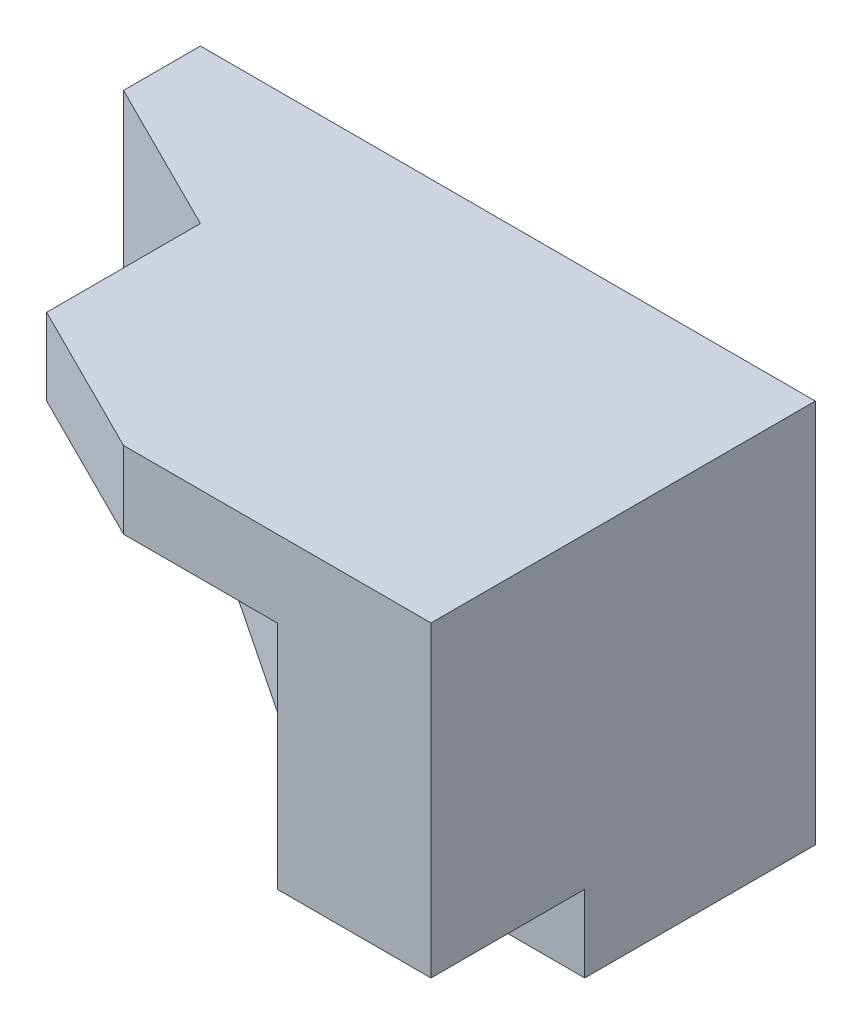
ISO-10303-21;
HEADER;
FILE_DESCRIPTION(('STEP AP214'),'2;1');
FILE_NAME('part.step','',(''),(''),'','','');
FILE_SCHEMA(('AUTOMOTIVE_DESIGN { 1 0 10303 214 1 1 1 1 }'));
ENDSEC;
DATA;
#1=APPLICATION_CONTEXT('core data for automotive mechanical design processes');
#2=APPLICATION_PROTOCOL_DEFINITION('international standard','automotive_design',2000,#1);
#3=PRODUCT_CONTEXT('',#1,'mechanical');
#4=PRODUCT('Part','Part','',(#3));
#5=PRODUCT_RELATED_PRODUCT_CATEGORY('part','',(#4));
#6=PRODUCT_DEFINITION_FORMATION('','',#4);
#7=PRODUCT_DEFINITION_CONTEXT('part definition',#1,'design');
#8=PRODUCT_DEFINITION('design','',#6,#7);
#9=PRODUCT_DEFINITION_SHAPE('','',#8);
#10=(LENGTH_UNIT() NAMED_UNIT(*) SI_UNIT(.MILLI.,.METRE.));
#11=(NAMED_UNIT(*) PLANE_ANGLE_UNIT() SI_UNIT($,.RADIAN.));
#12=(NAMED_UNIT(*) SI_UNIT($,.STERADIAN.) SOLID_ANGLE_UNIT());
#13=UNCERTAINTY_MEASURE_WITH_UNIT(LENGTH_MEASURE(1.E-05),#10,'distance_accuracy_value','');
#14=(GEOMETRIC_REPRESENTATION_CONTEXT(3) GLOBAL_UNCERTAINTY_ASSIGNED_CONTEXT((#13)) GLOBAL_UNIT_ASSIGNED_CONTEXT((#10,
#11,#12)) REPRESENTATION_CONTEXT('',''));
#15=CARTESIAN_POINT('',(0.,0.,0.));
#16=DIRECTION('',(0.,0.,1.));
#17=DIRECTION('',(1.,0.,0.));
#18=AXIS2_PLACEMENT_3D('',#15,#16,#17);
#19=CARTESIAN_POINT('',(20.,50.,23.4135169851584));
#20=DIRECTION('',(-1.,0.,0.));
#21=DIRECTION('',(0.,-1.,0.));
#22=AXIS2_PLACEMENT_3D('',#19,#20,#21);
#23=PLANE('',#22);
#24=DIRECTION('',(0.,0.,-1.));
#25=VECTOR('',#24,1.);
#26=CARTESIAN_POINT('',(20.,50.,40.));
#27=LINE('',#26,#25);
#28=CARTESIAN_POINT('',(20.,50.,40.));
#29=VERTEX_POINT('',#28);
#30=CARTESIAN_POINT('',(20.,50.,20.));
#31=VERTEX_POINT('',#30);
#32=EDGE_CURVE('E173',#29,#31,#27,.T.);
#33=ORIENTED_EDGE('',*,*,#32,.T.);
#34=DIRECTION('',(0.,-1.,0.));
#35=VECTOR('',#34,1.);
#36=CARTESIAN_POINT('',(20.,50.,20.));
#37=LINE('',#36,#35);
#38=CARTESIAN_POINT('',(20.,40.,20.));
#39=VERTEX_POINT('',#38);
#40=EDGE_CURVE('E11',#31,#39,#37,.T.);
#41=ORIENTED_EDGE('',*,*,#40,.T.);
#42=DIRECTION('',(0.,0.,-1.));
#43=VECTOR('',#42,1.);
#44=CARTESIAN_POINT('',(20.,40.,23.4135169851584));
#45=LINE('',#44,#43);
#46=CARTESIAN_POINT('',(20.,40.,40.));
#47=VERTEX_POINT('',#46);
#48=EDGE_CURVE('E166',#47,#39,#45,.T.);
#49=ORIENTED_EDGE('',*,*,#48,.F.);
#50=DIRECTION('',(0.,-1.,0.));
#51=VECTOR('',#50,1.);
#52=CARTESIAN_POINT('',(20.,50.,40.));
#53=LINE('',#52,#51);
#54=EDGE_CURVE('E174',#29,#47,#53,.T.);
#55=ORIENTED_EDGE('',*,*,#54,.F.);
#56=EDGE_LOOP('',(#33,#41,#49,#55));
#57=FACE_BOUND('',#56,.T.);
#58=ADVANCED_FACE('F35',(#57),#23,.T.);
#59=CARTESIAN_POINT('',(0.,0.,0.));
#60=DIRECTION('',(0.,0.,-1.));
#61=DIRECTION('',(-1.,0.,0.));
#62=AXIS2_PLACEMENT_3D('',#59,#60,#61);
#63=PLANE('',#62);
#64=DIRECTION('',(0.,-1.,0.));
#65=VECTOR('',#64,1.);
#66=CARTESIAN_POINT('',(0.,0.,0.));
#67=LINE('',#66,#65);
#68=CARTESIAN_POINT('',(0.,50.,0.));
#69=VERTEX_POINT('',#68);
#70=CARTESIAN_POINT('',(0.,30.,0.));
#71=VERTEX_POINT('',#70);
#72=EDGE_CURVE('E154',#69,#71,#67,.T.);
#73=ORIENTED_EDGE('',*,*,#72,.F.);
#74=DIRECTION('',(-1.,0.,0.));
#75=VECTOR('',#74,1.);
#76=CARTESIAN_POINT('',(0.,50.,0.));
#77=LINE('',#76,#75);
#78=CARTESIAN_POINT('',(80.,50.,0.));
#79=VERTEX_POINT('',#78);
#80=EDGE_CURVE('E149',#79,#69,#77,.T.);
#81=ORIENTED_EDGE('',*,*,#80,.F.);
#82=DIRECTION('',(0.,1.,0.));
#83=VECTOR('',#82,1.);
#84=CARTESIAN_POINT('',(80.,0.,0.));
#85=LINE('',#84,#83);
#86=CARTESIAN_POINT('',(80.,0.,0.));
#87=VERTEX_POINT('',#86);
#88=EDGE_CURVE('E252',#87,#79,#85,.T.);
#89=ORIENTED_EDGE('',*,*,#88,.F.);
#90=DIRECTION('',(1.,0.,0.));
#91=VECTOR('',#90,1.);
#92=CARTESIAN_POINT('',(0.,0.,0.));
#93=LINE('',#92,#91);
#94=CARTESIAN_POINT('',(60.,0.,0.));
#95=VERTEX_POINT('',#94);
#96=EDGE_CURVE('E250',#95,#87,#93,.T.);
#97=ORIENTED_EDGE('',*,*,#96,.F.);
#98=DIRECTION('',(0.,1.,0.));
#99=VECTOR('',#98,1.);
#100=CARTESIAN_POINT('',(60.,0.,0.));
#101=LINE('',#100,#99);
#102=CARTESIAN_POINT('',(60.,10.,0.));
#103=VERTEX_POINT('',#102);
#104=EDGE_CURVE('E235',#95,#103,#101,.T.);
#105=ORIENTED_EDGE('',*,*,#104,.T.);
#106=DIRECTION('',(-1.,0.,0.));
#107=VECTOR('',#106,1.);
#108=CARTESIAN_POINT('',(60.,10.,0.));
#109=LINE('',#108,#107);
#110=CARTESIAN_POINT('',(40.,10.,0.));
#111=VERTEX_POINT('',#110);
#112=EDGE_CURVE('E238',#103,#111,#109,.T.);
#113=ORIENTED_EDGE('',*,*,#112,.T.);
#114=DIRECTION('',(-0.894427190999916,0.447213595499958,0.));
#115=VECTOR('',#114,1.);
#116=CARTESIAN_POINT('',(40.,10.,0.));
#117=LINE('',#116,#115);
#118=EDGE_CURVE('E228',#111,#71,#117,.T.);
#119=ORIENTED_EDGE('',*,*,#118,.T.);
#120=EDGE_LOOP('',(#73,#81,#89,#97,#105,#113,#119));
#121=FACE_BOUND('',#120,.T.);
#122=ADVANCED_FACE('F269',(#121),#63,.T.);
#123=CARTESIAN_POINT('',(80.,40.,10.));
#124=DIRECTION('',(0.,-1.,0.));
#125=DIRECTION('',(1.,0.,0.));
#126=AXIS2_PLACEMENT_3D('',#123,#124,#125);
#127=PLANE('',#126);
#128=ORIENTED_EDGE('',*,*,#48,.T.);
#129=DIRECTION('',(0.894427190999916,0.,0.447213595499958));
#130=VECTOR('',#129,1.);
#131=CARTESIAN_POINT('',(60.,40.,40.));
#132=LINE('',#131,#130);
#133=CARTESIAN_POINT('',(60.,40.,40.));
#134=VERTEX_POINT('',#133);
#135=EDGE_CURVE('E53',#39,#134,#132,.T.);
#136=ORIENTED_EDGE('',*,*,#135,.T.);
#137=DIRECTION('',(0.,0.,1.));
#138=VECTOR('',#137,1.);
#139=CARTESIAN_POINT('',(60.,40.,40.));
#140=LINE('',#139,#138);
#141=CARTESIAN_POINT('',(60.,40.,50.));
#142=VERTEX_POINT('',#141);
#143=EDGE_CURVE('E185',#134,#142,#140,.T.);
#144=ORIENTED_EDGE('',*,*,#143,.T.);
#145=DIRECTION('',(1.,0.,0.));
#146=VECTOR('',#145,1.);
#147=CARTESIAN_POINT('',(80.,40.,50.));
#148=LINE('',#147,#146);
#149=CARTESIAN_POINT('',(40.,40.,50.));
#150=VERTEX_POINT('',#149);
#151=EDGE_CURVE('E183',#150,#142,#148,.T.);
#152=ORIENTED_EDGE('',*,*,#151,.F.);
#153=DIRECTION('',(-0.894427190999916,0.,-0.447213595499958));
#154=VECTOR('',#153,1.);
#155=CARTESIAN_POINT('',(40.,40.,50.));
#156=LINE('',#155,#154);
#157=EDGE_CURVE('E163',#150,#47,#156,.T.);
#158=ORIENTED_EDGE('',*,*,#157,.T.);
#159=EDGE_LOOP('',(#128,#136,#144,#152,#158));
#160=FACE_BOUND('',#159,.T.);
#161=ADVANCED_FACE('F302',(#160),#127,.T.);
#162=CARTESIAN_POINT('',(0.,0.,10.));
#163=DIRECTION('',(1.,0.,0.));
#164=DIRECTION('',(0.,0.,-1.));
#165=AXIS2_PLACEMENT_3D('',#162,#163,#164);
#166=PLANE('',#165);
#167=ORIENTED_EDGE('',*,*,#72,.T.);
#168=DIRECTION('',(0.,0.,1.));
#169=VECTOR('',#168,1.);
#170=CARTESIAN_POINT('',(0.,30.,0.));
#171=LINE('',#170,#169);
#172=CARTESIAN_POINT('',(0.,30.,10.));
#173=VERTEX_POINT('',#172);
#174=EDGE_CURVE('E152',#71,#173,#171,.T.);
#175=ORIENTED_EDGE('',*,*,#174,.T.);
#176=DIRECTION('',(0.,-1.,0.));
#177=VECTOR('',#176,1.);
#178=CARTESIAN_POINT('',(0.,0.,10.));
#179=LINE('',#178,#177);
#180=CARTESIAN_POINT('',(0.,50.,10.));
#181=VERTEX_POINT('',#180);
#182=EDGE_CURVE('E138',#181,#173,#179,.T.);
#183=ORIENTED_EDGE('',*,*,#182,.F.);
#184=DIRECTION('',(0.,0.,-1.));
#185=VECTOR('',#184,1.);
#186=CARTESIAN_POINT('',(0.,50.,10.));
#187=LINE('',#186,#185);
#188=EDGE_CURVE('E148',#181,#69,#187,.T.);
#189=ORIENTED_EDGE('',*,*,#188,.T.);
#190=EDGE_LOOP('',(#167,#175,#183,#189));
#191=FACE_BOUND('',#190,.T.);
#192=ADVANCED_FACE('F37',(#191),#166,.F.);
#193=CARTESIAN_POINT('',(0.,0.,10.));
#194=DIRECTION('',(0.,1.,0.));
#195=DIRECTION('',(0.,0.,1.));
#196=AXIS2_PLACEMENT_3D('',#193,#194,#195);
#197=PLANE('',#196);
#198=DIRECTION('',(0.,0.,-1.));
#199=VECTOR('',#198,1.);
#200=CARTESIAN_POINT('',(80.,0.,10.));
#201=LINE('',#200,#199);
#202=CARTESIAN_POINT('',(80.,0.,30.));
#203=VERTEX_POINT('',#202);
#204=EDGE_CURVE('E43',#203,#87,#201,.T.);
#205=ORIENTED_EDGE('',*,*,#204,.F.);
#206=DIRECTION('',(-1.,0.,0.));
#207=VECTOR('',#206,1.);
#208=CARTESIAN_POINT('',(80.,0.,30.));
#209=LINE('',#208,#207);
#210=CARTESIAN_POINT('',(70.,0.,30.));
#211=VERTEX_POINT('',#210);
#212=EDGE_CURVE('E208',#203,#211,#209,.T.);
#213=ORIENTED_EDGE('',*,*,#212,.T.);
#214=DIRECTION('',(0.,0.,-1.));
#215=VECTOR('',#214,1.);
#216=CARTESIAN_POINT('',(70.,0.,30.));
#217=LINE('',#216,#215);
#218=CARTESIAN_POINT('',(70.,0.,20.));
#219=VERTEX_POINT('',#218);
#220=EDGE_CURVE('E221',#211,#219,#217,.T.);
#221=ORIENTED_EDGE('',*,*,#220,.T.);
#222=DIRECTION('',(-0.707106781186548,0.,-0.707106781186547));
#223=VECTOR('',#222,1.);
#224=CARTESIAN_POINT('',(70.,0.,20.));
#225=LINE('',#224,#223);
#226=CARTESIAN_POINT('',(60.,0.,10.));
#227=VERTEX_POINT('',#226);
#228=EDGE_CURVE('E213',#219,#227,#225,.T.);
#229=ORIENTED_EDGE('',*,*,#228,.T.);
#230=DIRECTION('',(0.,0.,1.));
#231=VECTOR('',#230,1.);
#232=CARTESIAN_POINT('',(60.,0.,0.));
#233=LINE('',#232,#231);
#234=EDGE_CURVE('E244',#95,#227,#233,.T.);
#235=ORIENTED_EDGE('',*,*,#234,.F.);
#236=ORIENTED_EDGE('',*,*,#96,.T.);
#237=EDGE_LOOP('',(#205,#213,#221,#229,#235,#236));
#238=FACE_BOUND('',#237,.T.);
#239=ADVANCED_FACE('F287',(#238),#197,.F.);
#240=CARTESIAN_POINT('',(80.,0.,10.));
#241=DIRECTION('',(-1.,0.,0.));
#242=DIRECTION('',(0.,0.,1.));
#243=AXIS2_PLACEMENT_3D('',#240,#241,#242);
#244=PLANE('',#243);
#245=DIRECTION('',(0.,-1.,0.));
#246=VECTOR('',#245,1.);
#247=CARTESIAN_POINT('',(80.,50.,50.));
#248=LINE('',#247,#246);
#249=CARTESIAN_POINT('',(80.,50.,50.));
#250=VERTEX_POINT('',#249);
#251=CARTESIAN_POINT('',(80.,10.,50.));
#252=VERTEX_POINT('',#251);
#253=EDGE_CURVE('E192',#250,#252,#248,.T.);
#254=ORIENTED_EDGE('',*,*,#253,.T.);
#255=DIRECTION('',(0.,0.,1.));
#256=VECTOR('',#255,1.);
#257=CARTESIAN_POINT('',(80.,10.,10.));
#258=LINE('',#257,#256);
#259=CARTESIAN_POINT('',(80.,10.,30.));
#260=VERTEX_POINT('',#259);
#261=EDGE_CURVE('E200',#260,#252,#258,.T.);
#262=ORIENTED_EDGE('',*,*,#261,.F.);
#263=DIRECTION('',(0.,-1.,0.));
#264=VECTOR('',#263,1.);
#265=CARTESIAN_POINT('',(80.,10.,30.));
#266=LINE('',#265,#264);
#267=EDGE_CURVE('E218',#260,#203,#266,.T.);
#268=ORIENTED_EDGE('',*,*,#267,.T.);
#269=ORIENTED_EDGE('',*,*,#204,.T.);
#270=ORIENTED_EDGE('',*,*,#88,.T.);
#271=DIRECTION('',(0.,0.,-1.));
#272=VECTOR('',#271,1.);
#273=CARTESIAN_POINT('',(80.,50.,10.));
#274=LINE('',#273,#272);
#275=EDGE_CURVE('E257',#250,#79,#274,.T.);
#276=ORIENTED_EDGE('',*,*,#275,.F.);
#277=EDGE_LOOP('',(#254,#262,#268,#269,#270,#276));
#278=FACE_BOUND('',#277,.T.);
#279=ADVANCED_FACE('F261',(#278),#244,.F.);
#280=CARTESIAN_POINT('',(0.,50.,10.));
#281=DIRECTION('',(0.,-1.,0.));
#282=DIRECTION('',(0.,0.,-1.));
#283=AXIS2_PLACEMENT_3D('',#280,#281,#282);
#284=PLANE('',#283);
#285=ORIENTED_EDGE('',*,*,#188,.F.);
#286=DIRECTION('',(0.894427190999916,0.,0.447213595499958));
#287=VECTOR('',#286,1.);
#288=CARTESIAN_POINT('',(20.,50.,20.));
#289=LINE('',#288,#287);
#290=EDGE_CURVE('E145',#181,#31,#289,.T.);
#291=ORIENTED_EDGE('',*,*,#290,.T.);
#292=ORIENTED_EDGE('',*,*,#32,.F.);
#293=DIRECTION('',(-0.894427190999916,0.,-0.447213595499958));
#294=VECTOR('',#293,1.);
#295=CARTESIAN_POINT('',(40.,50.,50.));
#296=LINE('',#295,#294);
#297=CARTESIAN_POINT('',(40.,50.,50.));
#298=VERTEX_POINT('',#297);
#299=EDGE_CURVE('E170',#298,#29,#296,.T.);
#300=ORIENTED_EDGE('',*,*,#299,.F.);
#301=DIRECTION('',(-1.,0.,0.));
#302=VECTOR('',#301,1.);
#303=CARTESIAN_POINT('',(80.,50.,50.));
#304=LINE('',#303,#302);
#305=EDGE_CURVE('E190',#250,#298,#304,.T.);
#306=ORIENTED_EDGE('',*,*,#305,.F.);
#307=ORIENTED_EDGE('',*,*,#275,.T.);
#308=ORIENTED_EDGE('',*,*,#80,.T.);
#309=EDGE_LOOP('',(#285,#291,#292,#300,#306,#307,#308));
#310=FACE_BOUND('',#309,.T.);
#311=ADVANCED_FACE('F271',(#310),#284,.F.);
#312=CARTESIAN_POINT('',(60.,0.,0.));
#313=DIRECTION('',(1.,0.,0.));
#314=DIRECTION('',(0.,0.,-1.));
#315=AXIS2_PLACEMENT_3D('',#312,#313,#314);
#316=PLANE('',#315);
#317=DIRECTION('',(0.,1.,0.));
#318=VECTOR('',#317,1.);
#319=CARTESIAN_POINT('',(60.,0.,10.));
#320=LINE('',#319,#318);
#321=CARTESIAN_POINT('',(60.,10.,9.99999999999999));
#322=VERTEX_POINT('',#321);
#323=EDGE_CURVE('E157',#227,#322,#320,.T.);
#324=ORIENTED_EDGE('',*,*,#323,.T.);
#325=DIRECTION('',(0.,0.,1.));
#326=VECTOR('',#325,1.);
#327=CARTESIAN_POINT('',(60.,10.,0.));
#328=LINE('',#327,#326);
#329=EDGE_CURVE('E241',#103,#322,#328,.T.);
#330=ORIENTED_EDGE('',*,*,#329,.F.);
#331=ORIENTED_EDGE('',*,*,#104,.F.);
#332=ORIENTED_EDGE('',*,*,#234,.T.);
#333=EDGE_LOOP('',(#324,#330,#331,#332));
#334=FACE_BOUND('',#333,.T.);
#335=ADVANCED_FACE('F296',(#334),#316,.F.);
#336=CARTESIAN_POINT('',(60.,10.,0.));
#337=DIRECTION('',(0.,1.,0.));
#338=DIRECTION('',(-1.,0.,0.));
#339=AXIS2_PLACEMENT_3D('',#336,#337,#338);
#340=PLANE('',#339);
#341=DIRECTION('',(-0.894427190999916,0.,-0.447213595499957));
#342=VECTOR('',#341,1.);
#343=CARTESIAN_POINT('',(60.,10.,40.));
#344=LINE('',#343,#342);
#345=CARTESIAN_POINT('',(60.,10.,40.));
#346=VERTEX_POINT('',#345);
#347=CARTESIAN_POINT('',(40.,10.,30.));
#348=VERTEX_POINT('',#347);
#349=EDGE_CURVE('E204',#346,#348,#344,.T.);
#350=ORIENTED_EDGE('',*,*,#349,.T.);
#351=DIRECTION('',(0.,0.,1.));
#352=VECTOR('',#351,1.);
#353=CARTESIAN_POINT('',(40.,10.,0.));
#354=LINE('',#353,#352);
#355=EDGE_CURVE('E158',#111,#348,#354,.T.);
#356=ORIENTED_EDGE('',*,*,#355,.F.);
#357=ORIENTED_EDGE('',*,*,#112,.F.);
#358=ORIENTED_EDGE('',*,*,#329,.T.);
#359=DIRECTION('',(-0.707106781186548,0.,-0.707106781186547));
#360=VECTOR('',#359,1.);
#361=CARTESIAN_POINT('',(70.,10.,20.));
#362=LINE('',#361,#360);
#363=CARTESIAN_POINT('',(70.,10.,20.));
#364=VERTEX_POINT('',#363);
#365=EDGE_CURVE('E216',#364,#322,#362,.T.);
#366=ORIENTED_EDGE('',*,*,#365,.F.);
#367=DIRECTION('',(0.,0.,-1.));
#368=VECTOR('',#367,1.);
#369=CARTESIAN_POINT('',(70.,10.,30.));
#370=LINE('',#369,#368);
#371=CARTESIAN_POINT('',(70.,10.,30.));
#372=VERTEX_POINT('',#371);
#373=EDGE_CURVE('E212',#372,#364,#370,.T.);
#374=ORIENTED_EDGE('',*,*,#373,.F.);
#375=DIRECTION('',(-1.,0.,0.));
#376=VECTOR('',#375,1.);
#377=CARTESIAN_POINT('',(80.,10.,30.));
#378=LINE('',#377,#376);
#379=EDGE_CURVE('E209',#260,#372,#378,.T.);
#380=ORIENTED_EDGE('',*,*,#379,.F.);
#381=ORIENTED_EDGE('',*,*,#261,.T.);
#382=DIRECTION('',(-1.,0.,0.));
#383=VECTOR('',#382,1.);
#384=CARTESIAN_POINT('',(80.,10.,50.));
#385=LINE('',#384,#383);
#386=CARTESIAN_POINT('',(60.,10.,50.));
#387=VERTEX_POINT('',#386);
#388=EDGE_CURVE('E189',#252,#387,#385,.T.);
#389=ORIENTED_EDGE('',*,*,#388,.T.);
#390=DIRECTION('',(0.,0.,-1.));
#391=VECTOR('',#390,1.);
#392=CARTESIAN_POINT('',(60.,10.,40.));
#393=LINE('',#392,#391);
#394=EDGE_CURVE('E193',#387,#346,#393,.T.);
#395=ORIENTED_EDGE('',*,*,#394,.T.);
#396=EDGE_LOOP('',(#350,#356,#357,#358,#366,#374,#380,#381,#389,#395));
#397=FACE_BOUND('',#396,.T.);
#398=ADVANCED_FACE('F282',(#397),#340,.F.);
#399=CARTESIAN_POINT('',(40.,10.,0.));
#400=DIRECTION('',(0.447213595499958,0.894427190999916,0.));
#401=DIRECTION('',(-0.894427190999916,0.447213595499958,0.));
#402=AXIS2_PLACEMENT_3D('',#399,#400,#401);
#403=PLANE('',#402);
#404=ORIENTED_EDGE('',*,*,#355,.T.);
#405=DIRECTION('',(-0.816496580927726,0.408248290463863,-0.408248290463863));
#406=VECTOR('',#405,1.);
#407=CARTESIAN_POINT('',(0.,30.,10.));
#408=LINE('',#407,#406);
#409=EDGE_CURVE('E143',#348,#173,#408,.T.);
#410=ORIENTED_EDGE('',*,*,#409,.T.);
#411=ORIENTED_EDGE('',*,*,#174,.F.);
#412=ORIENTED_EDGE('',*,*,#118,.F.);
#413=EDGE_LOOP('',(#404,#410,#411,#412));
#414=FACE_BOUND('',#413,.T.);
#415=ADVANCED_FACE('F160',(#414),#403,.F.);
#416=CARTESIAN_POINT('',(70.,10.,20.));
#417=DIRECTION('',(-0.707106781186547,0.,0.707106781186548));
#418=DIRECTION('',(0.707106781186548,0.,0.707106781186547));
#419=AXIS2_PLACEMENT_3D('',#416,#417,#418);
#420=PLANE('',#419);
#421=ORIENTED_EDGE('',*,*,#228,.F.);
#422=DIRECTION('',(0.,-1.,0.));
#423=VECTOR('',#422,1.);
#424=CARTESIAN_POINT('',(70.,10.,20.));
#425=LINE('',#424,#423);
#426=EDGE_CURVE('E226',#364,#219,#425,.T.);
#427=ORIENTED_EDGE('',*,*,#426,.F.);
#428=ORIENTED_EDGE('',*,*,#365,.T.);
#429=ORIENTED_EDGE('',*,*,#323,.F.);
#430=EDGE_LOOP('',(#421,#427,#428,#429));
#431=FACE_BOUND('',#430,.T.);
#432=ADVANCED_FACE('F294',(#431),#420,.T.);
#433=CARTESIAN_POINT('',(70.,10.,30.));
#434=DIRECTION('',(-1.,0.,0.));
#435=DIRECTION('',(0.,0.,1.));
#436=AXIS2_PLACEMENT_3D('',#433,#434,#435);
#437=PLANE('',#436);
#438=ORIENTED_EDGE('',*,*,#220,.F.);
#439=DIRECTION('',(0.,-1.,0.));
#440=VECTOR('',#439,1.);
#441=CARTESIAN_POINT('',(70.,10.,30.));
#442=LINE('',#441,#440);
#443=EDGE_CURVE('E229',#372,#211,#442,.T.);
#444=ORIENTED_EDGE('',*,*,#443,.F.);
#445=ORIENTED_EDGE('',*,*,#373,.T.);
#446=ORIENTED_EDGE('',*,*,#426,.T.);
#447=EDGE_LOOP('',(#438,#444,#445,#446));
#448=FACE_BOUND('',#447,.T.);
#449=ADVANCED_FACE('F291',(#448),#437,.T.);
#450=CARTESIAN_POINT('',(80.,10.,30.));
#451=DIRECTION('',(0.,0.,1.));
#452=DIRECTION('',(1.,0.,0.));
#453=AXIS2_PLACEMENT_3D('',#450,#451,#452);
#454=PLANE('',#453);
#455=ORIENTED_EDGE('',*,*,#212,.F.);
#456=ORIENTED_EDGE('',*,*,#267,.F.);
#457=ORIENTED_EDGE('',*,*,#379,.T.);
#458=ORIENTED_EDGE('',*,*,#443,.T.);
#459=EDGE_LOOP('',(#455,#456,#457,#458));
#460=FACE_BOUND('',#459,.T.);
#461=ADVANCED_FACE('F284',(#460),#454,.T.);
#462=CARTESIAN_POINT('',(60.,50.,40.));
#463=DIRECTION('',(-0.447213595499957,0.,0.894427190999916));
#464=DIRECTION('',(0.894427190999916,0.,0.447213595499958));
#465=AXIS2_PLACEMENT_3D('',#462,#463,#464);
#466=PLANE('',#465);
#467=ORIENTED_EDGE('',*,*,#290,.F.);
#468=ORIENTED_EDGE('',*,*,#182,.T.);
#469=ORIENTED_EDGE('',*,*,#409,.F.);
#470=ORIENTED_EDGE('',*,*,#349,.F.);
#471=DIRECTION('',(0.,-1.,0.));
#472=VECTOR('',#471,1.);
#473=CARTESIAN_POINT('',(60.,50.,40.));
#474=LINE('',#473,#472);
#475=EDGE_CURVE('E206',#134,#346,#474,.T.);
#476=ORIENTED_EDGE('',*,*,#475,.F.);
#477=ORIENTED_EDGE('',*,*,#135,.F.);
#478=ORIENTED_EDGE('',*,*,#40,.F.);
#479=EDGE_LOOP('',(#467,#468,#469,#470,#476,#477,#478));
#480=FACE_BOUND('',#479,.T.);
#481=ADVANCED_FACE('F140',(#480),#466,.T.);
#482=CARTESIAN_POINT('',(60.,50.,40.));
#483=DIRECTION('',(-1.,0.,0.));
#484=DIRECTION('',(0.,-1.,0.));
#485=AXIS2_PLACEMENT_3D('',#482,#483,#484);
#486=PLANE('',#485);
#487=ORIENTED_EDGE('',*,*,#143,.F.);
#488=ORIENTED_EDGE('',*,*,#475,.T.);
#489=ORIENTED_EDGE('',*,*,#394,.F.);
#490=DIRECTION('',(0.,-1.,0.));
#491=VECTOR('',#490,1.);
#492=CARTESIAN_POINT('',(60.,50.,50.));
#493=LINE('',#492,#491);
#494=EDGE_CURVE('E198',#142,#387,#493,.T.);
#495=ORIENTED_EDGE('',*,*,#494,.F.);
#496=EDGE_LOOP('',(#487,#488,#489,#495));
#497=FACE_BOUND('',#496,.T.);
#498=ADVANCED_FACE('F300',(#497),#486,.T.);
#499=CARTESIAN_POINT('',(80.,50.,50.));
#500=DIRECTION('',(0.,0.,1.));
#501=DIRECTION('',(1.,0.,0.));
#502=AXIS2_PLACEMENT_3D('',#499,#500,#501);
#503=PLANE('',#502);
#504=ORIENTED_EDGE('',*,*,#388,.F.);
#505=ORIENTED_EDGE('',*,*,#253,.F.);
#506=ORIENTED_EDGE('',*,*,#305,.T.);
#507=DIRECTION('',(0.,-1.,0.));
#508=VECTOR('',#507,1.);
#509=CARTESIAN_POINT('',(40.,50.,50.));
#510=LINE('',#509,#508);
#511=EDGE_CURVE('E180',#298,#150,#510,.T.);
#512=ORIENTED_EDGE('',*,*,#511,.T.);
#513=ORIENTED_EDGE('',*,*,#151,.T.);
#514=ORIENTED_EDGE('',*,*,#494,.T.);
#515=EDGE_LOOP('',(#504,#505,#506,#512,#513,#514));
#516=FACE_BOUND('',#515,.T.);
#517=ADVANCED_FACE('F277',(#516),#503,.T.);
#518=CARTESIAN_POINT('',(40.,50.,50.));
#519=DIRECTION('',(-0.447213595499958,0.,0.894427190999916));
#520=DIRECTION('',(0.894427190999916,0.,0.447213595499958));
#521=AXIS2_PLACEMENT_3D('',#518,#519,#520);
#522=PLANE('',#521);
#523=ORIENTED_EDGE('',*,*,#157,.F.);
#524=ORIENTED_EDGE('',*,*,#511,.F.);
#525=ORIENTED_EDGE('',*,*,#299,.T.);
#526=ORIENTED_EDGE('',*,*,#54,.T.);
#527=EDGE_LOOP('',(#523,#524,#525,#526));
#528=FACE_BOUND('',#527,.T.);
#529=ADVANCED_FACE('F307',(#528),#522,.T.);
#530=CLOSED_SHELL('',(#58,#122,#161,#192,#239,#279,#311,#335,#398,#415,#432,#449,#461,#481,#498,
#517,#529));
#531=MANIFOLD_SOLID_BREP('B2',#530);
#532=ADVANCED_BREP_SHAPE_REPRESENTATION('',(#18,#531),#14);
#533=SHAPE_DEFINITION_REPRESENTATION(#9,#532);
ENDSEC;
END-ISO-10303-21;
